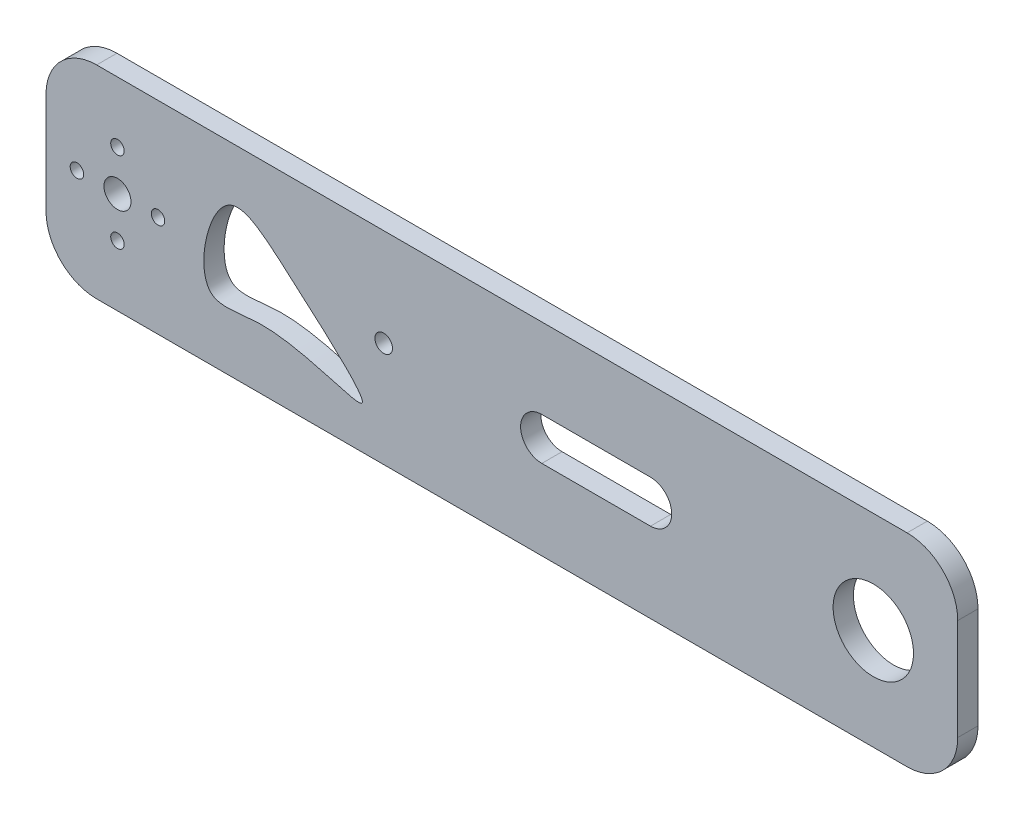
ISO-10303-21;
HEADER;
FILE_DESCRIPTION(('STEP AP214'),'2;1');
FILE_NAME('part.step','',(''),(''),'','','');
FILE_SCHEMA(('AUTOMOTIVE_DESIGN { 1 0 10303 214 1 1 1 1 }'));
ENDSEC;
DATA;
#1=APPLICATION_CONTEXT('core data for automotive mechanical design processes');
#2=APPLICATION_PROTOCOL_DEFINITION('international standard','automotive_design',2000,#1);
#3=PRODUCT_CONTEXT('',#1,'mechanical');
#4=PRODUCT('Part','Part','',(#3));
#5=PRODUCT_RELATED_PRODUCT_CATEGORY('part','',(#4));
#6=PRODUCT_DEFINITION_FORMATION('','',#4);
#7=PRODUCT_DEFINITION_CONTEXT('part definition',#1,'design');
#8=PRODUCT_DEFINITION('design','',#6,#7);
#9=PRODUCT_DEFINITION_SHAPE('','',#8);
#10=(LENGTH_UNIT() NAMED_UNIT(*) SI_UNIT(.MILLI.,.METRE.));
#11=(NAMED_UNIT(*) PLANE_ANGLE_UNIT() SI_UNIT($,.RADIAN.));
#12=(NAMED_UNIT(*) SI_UNIT($,.STERADIAN.) SOLID_ANGLE_UNIT());
#13=UNCERTAINTY_MEASURE_WITH_UNIT(LENGTH_MEASURE(1.E-05),#10,'distance_accuracy_value','');
#14=(GEOMETRIC_REPRESENTATION_CONTEXT(3) GLOBAL_UNCERTAINTY_ASSIGNED_CONTEXT((#13)) GLOBAL_UNIT_ASSIGNED_CONTEXT((#10,
#11,#12)) REPRESENTATION_CONTEXT('',''));
#15=CARTESIAN_POINT('',(0.,0.,0.));
#16=DIRECTION('',(0.,0.,1.));
#17=DIRECTION('',(1.,0.,0.));
#18=AXIS2_PLACEMENT_3D('',#15,#16,#17);
#19=CARTESIAN_POINT('',(135.,30.,3.));
#20=DIRECTION('',(-1.,0.,0.));
#21=DIRECTION('',(0.,0.,1.));
#22=AXIS2_PLACEMENT_3D('',#19,#20,#21);
#23=PLANE('',#22);
#24=DIRECTION('',(0.,1.,0.));
#25=VECTOR('',#24,1.);
#26=CARTESIAN_POINT('',(135.,30.,3.));
#27=LINE('',#26,#25);
#28=CARTESIAN_POINT('',(135.,-15.,3.));
#29=VERTEX_POINT('',#28);
#30=CARTESIAN_POINT('',(135.,15.,3.));
#31=VERTEX_POINT('',#30);
#32=EDGE_CURVE('E496',#29,#31,#27,.T.);
#33=ORIENTED_EDGE('',*,*,#32,.F.);
#34=DIRECTION('',(0.,0.,-1.));
#35=VECTOR('',#34,1.);
#36=CARTESIAN_POINT('',(135.,-15.,3.));
#37=LINE('',#36,#35);
#38=CARTESIAN_POINT('',(135.,-15.,-3.));
#39=VERTEX_POINT('',#38);
#40=EDGE_CURVE('E477',#29,#39,#37,.T.);
#41=ORIENTED_EDGE('',*,*,#40,.T.);
#42=DIRECTION('',(0.,1.,0.));
#43=VECTOR('',#42,1.);
#44=CARTESIAN_POINT('',(135.,30.,-3.));
#45=LINE('',#44,#43);
#46=CARTESIAN_POINT('',(135.,15.,-3.));
#47=VERTEX_POINT('',#46);
#48=EDGE_CURVE('E281',#39,#47,#45,.T.);
#49=ORIENTED_EDGE('',*,*,#48,.T.);
#50=DIRECTION('',(0.,0.,-1.));
#51=VECTOR('',#50,1.);
#52=CARTESIAN_POINT('',(135.,15.,3.));
#53=LINE('',#52,#51);
#54=EDGE_CURVE('E471',#47,#31,#53,.F.);
#55=ORIENTED_EDGE('',*,*,#54,.T.);
#56=EDGE_LOOP('',(#33,#41,#49,#55));
#57=FACE_BOUND('',#56,.T.);
#58=ADVANCED_FACE('F34',(#57),#23,.F.);
#59=CARTESIAN_POINT('',(-135.,30.,3.));
#60=DIRECTION('',(0.,-1.,0.));
#61=DIRECTION('',(0.,0.,-1.));
#62=AXIS2_PLACEMENT_3D('',#59,#60,#61);
#63=PLANE('',#62);
#64=DIRECTION('',(-1.,0.,0.));
#65=VECTOR('',#64,1.);
#66=CARTESIAN_POINT('',(-135.,30.,3.));
#67=LINE('',#66,#65);
#68=CARTESIAN_POINT('',(120.,30.,3.));
#69=VERTEX_POINT('',#68);
#70=CARTESIAN_POINT('',(-120.,30.,3.));
#71=VERTEX_POINT('',#70);
#72=EDGE_CURVE('E498',#69,#71,#67,.T.);
#73=ORIENTED_EDGE('',*,*,#72,.F.);
#74=DIRECTION('',(0.,0.,-1.));
#75=VECTOR('',#74,1.);
#76=CARTESIAN_POINT('',(120.,30.,3.));
#77=LINE('',#76,#75);
#78=CARTESIAN_POINT('',(120.,30.,-3.));
#79=VERTEX_POINT('',#78);
#80=EDGE_CURVE('E257',#69,#79,#77,.T.);
#81=ORIENTED_EDGE('',*,*,#80,.T.);
#82=DIRECTION('',(-1.,0.,0.));
#83=VECTOR('',#82,1.);
#84=CARTESIAN_POINT('',(-135.,30.,-3.));
#85=LINE('',#84,#83);
#86=CARTESIAN_POINT('',(-120.,30.,-3.));
#87=VERTEX_POINT('',#86);
#88=EDGE_CURVE('E501',#79,#87,#85,.T.);
#89=ORIENTED_EDGE('',*,*,#88,.T.);
#90=DIRECTION('',(0.,0.,-1.));
#91=VECTOR('',#90,1.);
#92=CARTESIAN_POINT('',(-120.,30.,3.));
#93=LINE('',#92,#91);
#94=EDGE_CURVE('E255',#87,#71,#93,.F.);
#95=ORIENTED_EDGE('',*,*,#94,.T.);
#96=EDGE_LOOP('',(#73,#81,#89,#95));
#97=FACE_BOUND('',#96,.T.);
#98=ADVANCED_FACE('F213',(#97),#63,.F.);
#99=CARTESIAN_POINT('',(-135.,30.,3.));
#100=DIRECTION('',(1.,0.,0.));
#101=DIRECTION('',(0.,0.,-1.));
#102=AXIS2_PLACEMENT_3D('',#99,#100,#101);
#103=PLANE('',#102);
#104=DIRECTION('',(0.,-1.,0.));
#105=VECTOR('',#104,1.);
#106=CARTESIAN_POINT('',(-135.,30.,-3.));
#107=LINE('',#106,#105);
#108=CARTESIAN_POINT('',(-135.,15.,-3.));
#109=VERTEX_POINT('',#108);
#110=CARTESIAN_POINT('',(-135.,-15.,-3.));
#111=VERTEX_POINT('',#110);
#112=EDGE_CURVE('E497',#109,#111,#107,.T.);
#113=ORIENTED_EDGE('',*,*,#112,.T.);
#114=DIRECTION('',(0.,0.,-1.));
#115=VECTOR('',#114,1.);
#116=CARTESIAN_POINT('',(-135.,-15.,3.));
#117=LINE('',#116,#115);
#118=CARTESIAN_POINT('',(-135.,-15.,3.));
#119=VERTEX_POINT('',#118);
#120=EDGE_CURVE('E238',#111,#119,#117,.F.);
#121=ORIENTED_EDGE('',*,*,#120,.T.);
#122=DIRECTION('',(0.,-1.,0.));
#123=VECTOR('',#122,1.);
#124=CARTESIAN_POINT('',(-135.,30.,3.));
#125=LINE('',#124,#123);
#126=CARTESIAN_POINT('',(-135.,15.,3.));
#127=VERTEX_POINT('',#126);
#128=EDGE_CURVE('E472',#127,#119,#125,.T.);
#129=ORIENTED_EDGE('',*,*,#128,.F.);
#130=DIRECTION('',(0.,0.,-1.));
#131=VECTOR('',#130,1.);
#132=CARTESIAN_POINT('',(-135.,15.,3.));
#133=LINE('',#132,#131);
#134=EDGE_CURVE('E260',#127,#109,#133,.T.);
#135=ORIENTED_EDGE('',*,*,#134,.T.);
#136=EDGE_LOOP('',(#113,#121,#129,#135));
#137=FACE_BOUND('',#136,.T.);
#138=ADVANCED_FACE('F209',(#137),#103,.F.);
#139=CARTESIAN_POINT('',(-135.,-30.,3.));
#140=DIRECTION('',(0.,1.,0.));
#141=DIRECTION('',(0.,0.,1.));
#142=AXIS2_PLACEMENT_3D('',#139,#140,#141);
#143=PLANE('',#142);
#144=DIRECTION('',(1.,0.,0.));
#145=VECTOR('',#144,1.);
#146=CARTESIAN_POINT('',(-135.,-30.,-3.));
#147=LINE('',#146,#145);
#148=CARTESIAN_POINT('',(-120.,-30.,-3.));
#149=VERTEX_POINT('',#148);
#150=CARTESIAN_POINT('',(120.,-30.,-3.));
#151=VERTEX_POINT('',#150);
#152=EDGE_CURVE('E494',#149,#151,#147,.T.);
#153=ORIENTED_EDGE('',*,*,#152,.T.);
#154=DIRECTION('',(0.,0.,-1.));
#155=VECTOR('',#154,1.);
#156=CARTESIAN_POINT('',(120.,-30.,3.));
#157=LINE('',#156,#155);
#158=CARTESIAN_POINT('',(120.,-30.,3.));
#159=VERTEX_POINT('',#158);
#160=EDGE_CURVE('E250',#151,#159,#157,.F.);
#161=ORIENTED_EDGE('',*,*,#160,.T.);
#162=DIRECTION('',(1.,0.,0.));
#163=VECTOR('',#162,1.);
#164=CARTESIAN_POINT('',(-135.,-30.,3.));
#165=LINE('',#164,#163);
#166=CARTESIAN_POINT('',(-120.,-30.,3.));
#167=VERTEX_POINT('',#166);
#168=EDGE_CURVE('E467',#167,#159,#165,.T.);
#169=ORIENTED_EDGE('',*,*,#168,.F.);
#170=DIRECTION('',(0.,0.,-1.));
#171=VECTOR('',#170,1.);
#172=CARTESIAN_POINT('',(-120.,-30.,3.));
#173=LINE('',#172,#171);
#174=EDGE_CURVE('E240',#167,#149,#173,.T.);
#175=ORIENTED_EDGE('',*,*,#174,.T.);
#176=EDGE_LOOP('',(#153,#161,#169,#175));
#177=FACE_BOUND('',#176,.T.);
#178=ADVANCED_FACE('F202',(#177),#143,.F.);
#179=CARTESIAN_POINT('',(0.,0.,3.));
#180=DIRECTION('',(0.,0.,1.));
#181=DIRECTION('',(1.,0.,0.));
#182=AXIS2_PLACEMENT_3D('',#179,#180,#181);
#183=PLANE('',#182);
#184=CARTESIAN_POINT('',(11.8296106303526,0.,3.));
#185=DIRECTION('',(0.,0.,1.));
#186=DIRECTION('',(1.,0.,0.));
#187=AXIS2_PLACEMENT_3D('',#184,#185,#186);
#188=CIRCLE('',#187,6.28053164739129);
#189=CARTESIAN_POINT('',(11.8296106303526,6.28053164739129,3.));
#190=VERTEX_POINT('',#189);
#191=CARTESIAN_POINT('',(11.8296106303526,-6.28053164739129,3.));
#192=VERTEX_POINT('',#191);
#193=EDGE_CURVE('E49',#190,#192,#188,.T.);
#194=ORIENTED_EDGE('',*,*,#193,.F.);
#195=DIRECTION('',(-1.,0.,0.));
#196=VECTOR('',#195,1.);
#197=CARTESIAN_POINT('',(11.8296106303526,6.28053164739129,3.));
#198=LINE('',#197,#196);
#199=CARTESIAN_POINT('',(44.0100175998004,6.28053164739129,3.));
#200=VERTEX_POINT('',#199);
#201=EDGE_CURVE('E142',#200,#190,#198,.T.);
#202=ORIENTED_EDGE('',*,*,#201,.F.);
#203=CARTESIAN_POINT('',(44.0100175998004,0.,3.));
#204=DIRECTION('',(0.,0.,1.));
#205=DIRECTION('',(1.,0.,0.));
#206=AXIS2_PLACEMENT_3D('',#203,#204,#205);
#207=CIRCLE('',#206,6.28053164739129);
#208=CARTESIAN_POINT('',(44.0100175998004,-6.28053164739129,3.));
#209=VERTEX_POINT('',#208);
#210=EDGE_CURVE('E126',#209,#200,#207,.T.);
#211=ORIENTED_EDGE('',*,*,#210,.F.);
#212=DIRECTION('',(1.,0.,0.));
#213=VECTOR('',#212,1.);
#214=CARTESIAN_POINT('',(11.8296106303526,-6.28053164739129,3.));
#215=LINE('',#214,#213);
#216=EDGE_CURVE('E135',#192,#209,#215,.T.);
#217=ORIENTED_EDGE('',*,*,#216,.F.);
#218=EDGE_LOOP('',(#194,#202,#211,#217));
#219=FACE_BOUND('',#218,.T.);
#220=CARTESIAN_POINT('',(-86.0182331804512,-11.6052804049951,3.));
#221=CARTESIAN_POINT('',(-83.2354508799588,-14.0450263619246,3.));
#222=CARTESIAN_POINT('',(-65.9297527283585,-8.61770067668569,3.));
#223=CARTESIAN_POINT('',(-27.0991493719671,-26.6229889453018,3.));
#224=CARTESIAN_POINT('',(-60.5624525641297,2.39071624951274,3.));
#225=CARTESIAN_POINT('',(-84.2293753403954,23.0926849093463,3.));
#226=CARTESIAN_POINT('',(-90.9561758645381,-7.27604282973843,3.));
#227=CARTESIAN_POINT('',(-86.0182331804512,-11.6052804049951,3.));
#228=B_SPLINE_CURVE_WITH_KNOTS('',3,(#220,#221,#222,#223,#224,#225,#226,#227),.UNSPECIFIED.,.T.,
.F.,(4,1,1,1,1,4),(0.,0.119398718854948,0.370043286577663,0.632863572495671,0.788131457442852,
1.),.UNSPECIFIED.);
#229=CARTESIAN_POINT('',(-86.0182331804512,-11.6052804049951,3.));
#230=VERTEX_POINT('',#229);
#231=EDGE_CURVE('E156',#230,#230,#228,.T.);
#232=ORIENTED_EDGE('',*,*,#231,.F.);
#233=EDGE_LOOP('',(#232));
#234=FACE_BOUND('',#233,.T.);
#235=CARTESIAN_POINT('',(-35.,1.12326696580291,3.));
#236=DIRECTION('',(0.,0.,1.));
#237=DIRECTION('',(1.,0.,0.));
#238=AXIS2_PLACEMENT_3D('',#235,#236,#237);
#239=CIRCLE('',#238,2.6);
#240=CARTESIAN_POINT('',(-32.4,1.12326696580291,3.));
#241=VERTEX_POINT('',#240);
#242=EDGE_CURVE('E286',#241,#241,#239,.T.);
#243=ORIENTED_EDGE('',*,*,#242,.F.);
#244=EDGE_LOOP('',(#243));
#245=FACE_BOUND('',#244,.T.);
#246=CARTESIAN_POINT('',(110.,0.,3.));
#247=DIRECTION('',(0.,0.,1.));
#248=DIRECTION('',(1.,0.,0.));
#249=AXIS2_PLACEMENT_3D('',#246,#247,#248);
#250=CIRCLE('',#249,11.9);
#251=CARTESIAN_POINT('',(121.9,0.,3.));
#252=VERTEX_POINT('',#251);
#253=EDGE_CURVE('E294',#252,#252,#250,.T.);
#254=ORIENTED_EDGE('',*,*,#253,.F.);
#255=EDGE_LOOP('',(#254));
#256=FACE_BOUND('',#255,.T.);
#257=CARTESIAN_POINT('',(-113.835271992654,12.,3.));
#258=DIRECTION('',(0.,0.,1.));
#259=DIRECTION('',(1.,0.,0.));
#260=AXIS2_PLACEMENT_3D('',#257,#258,#259);
#261=CIRCLE('',#260,2.);
#262=CARTESIAN_POINT('',(-111.835271992654,12.,3.));
#263=VERTEX_POINT('',#262);
#264=EDGE_CURVE('E453',#263,#263,#261,.T.);
#265=ORIENTED_EDGE('',*,*,#264,.F.);
#266=EDGE_LOOP('',(#265));
#267=FACE_BOUND('',#266,.T.);
#268=CARTESIAN_POINT('',(-113.835271992654,-12.,3.));
#269=DIRECTION('',(0.,0.,1.));
#270=DIRECTION('',(-1.,0.,0.));
#271=AXIS2_PLACEMENT_3D('',#268,#269,#270);
#272=CIRCLE('',#271,2.);
#273=CARTESIAN_POINT('',(-115.835271992654,-12.,3.));
#274=VERTEX_POINT('',#273);
#275=EDGE_CURVE('E457',#274,#274,#272,.T.);
#276=ORIENTED_EDGE('',*,*,#275,.F.);
#277=EDGE_LOOP('',(#276));
#278=FACE_BOUND('',#277,.T.);
#279=CARTESIAN_POINT('',(-101.835271992654,0.,3.));
#280=DIRECTION('',(0.,0.,1.));
#281=DIRECTION('',(1.,0.,0.));
#282=AXIS2_PLACEMENT_3D('',#279,#280,#281);
#283=CIRCLE('',#282,2.);
#284=CARTESIAN_POINT('',(-99.8352719926538,0.,3.));
#285=VERTEX_POINT('',#284);
#286=EDGE_CURVE('E461',#285,#285,#283,.T.);
#287=ORIENTED_EDGE('',*,*,#286,.F.);
#288=EDGE_LOOP('',(#287));
#289=FACE_BOUND('',#288,.T.);
#290=CARTESIAN_POINT('',(-125.835271992654,0.,3.));
#291=DIRECTION('',(0.,0.,1.));
#292=DIRECTION('',(-1.,0.,0.));
#293=AXIS2_PLACEMENT_3D('',#290,#291,#292);
#294=CIRCLE('',#293,2.);
#295=CARTESIAN_POINT('',(-127.835271992654,0.,3.));
#296=VERTEX_POINT('',#295);
#297=EDGE_CURVE('E289',#296,#296,#294,.T.);
#298=ORIENTED_EDGE('',*,*,#297,.F.);
#299=EDGE_LOOP('',(#298));
#300=FACE_BOUND('',#299,.T.);
#301=CARTESIAN_POINT('',(-113.835271992654,0.,3.));
#302=DIRECTION('',(0.,0.,1.));
#303=DIRECTION('',(1.,0.,0.));
#304=AXIS2_PLACEMENT_3D('',#301,#302,#303);
#305=CIRCLE('',#304,4.00000000000001);
#306=CARTESIAN_POINT('',(-109.835271992654,0.,3.));
#307=VERTEX_POINT('',#306);
#308=EDGE_CURVE('E269',#307,#307,#305,.T.);
#309=ORIENTED_EDGE('',*,*,#308,.F.);
#310=EDGE_LOOP('',(#309));
#311=FACE_BOUND('',#310,.T.);
#312=ORIENTED_EDGE('',*,*,#168,.T.);
#313=CARTESIAN_POINT('',(120.,-15.,3.));
#314=DIRECTION('',(0.,0.,1.));
#315=DIRECTION('',(1.,0.,0.));
#316=AXIS2_PLACEMENT_3D('',#313,#314,#315);
#317=CIRCLE('',#316,15.);
#318=EDGE_CURVE('E248',#159,#29,#317,.T.);
#319=ORIENTED_EDGE('',*,*,#318,.T.);
#320=ORIENTED_EDGE('',*,*,#32,.T.);
#321=CARTESIAN_POINT('',(120.,15.,3.));
#322=DIRECTION('',(0.,0.,1.));
#323=DIRECTION('',(1.,0.,0.));
#324=AXIS2_PLACEMENT_3D('',#321,#322,#323);
#325=CIRCLE('',#324,15.);
#326=EDGE_CURVE('E245',#31,#69,#325,.T.);
#327=ORIENTED_EDGE('',*,*,#326,.T.);
#328=ORIENTED_EDGE('',*,*,#72,.T.);
#329=CARTESIAN_POINT('',(-120.,15.,3.));
#330=DIRECTION('',(0.,0.,1.));
#331=DIRECTION('',(1.,0.,0.));
#332=AXIS2_PLACEMENT_3D('',#329,#330,#331);
#333=CIRCLE('',#332,15.);
#334=EDGE_CURVE('E246',#71,#127,#333,.T.);
#335=ORIENTED_EDGE('',*,*,#334,.T.);
#336=ORIENTED_EDGE('',*,*,#128,.T.);
#337=CARTESIAN_POINT('',(-120.,-15.,3.));
#338=DIRECTION('',(0.,0.,1.));
#339=DIRECTION('',(1.,0.,0.));
#340=AXIS2_PLACEMENT_3D('',#337,#338,#339);
#341=CIRCLE('',#340,15.);
#342=EDGE_CURVE('E237',#119,#167,#341,.T.);
#343=ORIENTED_EDGE('',*,*,#342,.T.);
#344=EDGE_LOOP('',(#312,#319,#320,#327,#328,#335,#336,#343));
#345=FACE_BOUND('',#344,.T.);
#346=ADVANCED_FACE('F139',(#219,#234,#245,#256,#267,#278,#289,#300,#311,#345),#183,.T.);
#347=CARTESIAN_POINT('',(0.,0.,-3.));
#348=DIRECTION('',(0.,0.,1.));
#349=DIRECTION('',(1.,0.,0.));
#350=AXIS2_PLACEMENT_3D('',#347,#348,#349);
#351=PLANE('',#350);
#352=DIRECTION('',(-1.,0.,0.));
#353=VECTOR('',#352,1.);
#354=CARTESIAN_POINT('',(0.,6.28053164739129,-3.));
#355=LINE('',#354,#353);
#356=CARTESIAN_POINT('',(44.0100175998004,6.28053164739129,-3.));
#357=VERTEX_POINT('',#356);
#358=CARTESIAN_POINT('',(11.8296106303526,6.28053164739129,-3.));
#359=VERTEX_POINT('',#358);
#360=EDGE_CURVE('E42',#357,#359,#355,.T.);
#361=ORIENTED_EDGE('',*,*,#360,.T.);
#362=CARTESIAN_POINT('',(11.8296106303526,0.,-3.));
#363=DIRECTION('',(0.,0.,1.));
#364=DIRECTION('',(1.,0.,0.));
#365=AXIS2_PLACEMENT_3D('',#362,#363,#364);
#366=CIRCLE('',#365,6.28053164739129);
#367=CARTESIAN_POINT('',(11.8296106303526,-6.28053164739129,-3.));
#368=VERTEX_POINT('',#367);
#369=EDGE_CURVE('E11',#359,#368,#366,.T.);
#370=ORIENTED_EDGE('',*,*,#369,.T.);
#371=DIRECTION('',(1.,0.,0.));
#372=VECTOR('',#371,1.);
#373=CARTESIAN_POINT('',(0.,-6.28053164739129,-3.));
#374=LINE('',#373,#372);
#375=CARTESIAN_POINT('',(44.0100175998004,-6.28053164739129,-3.));
#376=VERTEX_POINT('',#375);
#377=EDGE_CURVE('E264',#368,#376,#374,.T.);
#378=ORIENTED_EDGE('',*,*,#377,.T.);
#379=CARTESIAN_POINT('',(44.0100175998004,0.,-3.));
#380=DIRECTION('',(0.,0.,1.));
#381=DIRECTION('',(1.,0.,0.));
#382=AXIS2_PLACEMENT_3D('',#379,#380,#381);
#383=CIRCLE('',#382,6.28053164739129);
#384=EDGE_CURVE('E129',#376,#357,#383,.T.);
#385=ORIENTED_EDGE('',*,*,#384,.T.);
#386=EDGE_LOOP('',(#361,#370,#378,#385));
#387=FACE_BOUND('',#386,.T.);
#388=CARTESIAN_POINT('',(-86.0182331804512,-11.6052804049951,-3.));
#389=CARTESIAN_POINT('',(-83.2354508799588,-14.0450263619246,-3.));
#390=CARTESIAN_POINT('',(-65.9297527283585,-8.61770067668569,-3.));
#391=CARTESIAN_POINT('',(-27.0991493719671,-26.6229889453018,-3.));
#392=CARTESIAN_POINT('',(-60.5624525641297,2.39071624951274,-3.));
#393=CARTESIAN_POINT('',(-84.2293753403954,23.0926849093463,-3.));
#394=CARTESIAN_POINT('',(-90.9561758645381,-7.27604282973843,-3.));
#395=CARTESIAN_POINT('',(-86.0182331804512,-11.6052804049951,-3.));
#396=B_SPLINE_CURVE_WITH_KNOTS('',3,(#388,#389,#390,#391,#392,#393,#394,#395),.UNSPECIFIED.,.T.,
.F.,(4,1,1,1,1,4),(0.,0.119398718854948,0.370043286577663,0.632863572495671,0.788131457442852,
1.),.UNSPECIFIED.);
#397=CARTESIAN_POINT('',(-86.0182331804512,-11.6052804049951,-3.));
#398=VERTEX_POINT('',#397);
#399=EDGE_CURVE('E149',#398,#398,#396,.T.);
#400=ORIENTED_EDGE('',*,*,#399,.T.);
#401=EDGE_LOOP('',(#400));
#402=FACE_BOUND('',#401,.T.);
#403=CARTESIAN_POINT('',(-35.,1.12326696580291,-3.));
#404=DIRECTION('',(0.,0.,1.));
#405=DIRECTION('',(1.,0.,0.));
#406=AXIS2_PLACEMENT_3D('',#403,#404,#405);
#407=CIRCLE('',#406,2.6);
#408=CARTESIAN_POINT('',(-32.4,1.12326696580291,-3.));
#409=VERTEX_POINT('',#408);
#410=EDGE_CURVE('E285',#409,#409,#407,.T.);
#411=ORIENTED_EDGE('',*,*,#410,.T.);
#412=EDGE_LOOP('',(#411));
#413=FACE_BOUND('',#412,.T.);
#414=CARTESIAN_POINT('',(110.,0.,-3.));
#415=DIRECTION('',(0.,0.,1.));
#416=DIRECTION('',(1.,0.,0.));
#417=AXIS2_PLACEMENT_3D('',#414,#415,#416);
#418=CIRCLE('',#417,11.9);
#419=CARTESIAN_POINT('',(121.9,0.,-3.));
#420=VERTEX_POINT('',#419);
#421=EDGE_CURVE('E282',#420,#420,#418,.T.);
#422=ORIENTED_EDGE('',*,*,#421,.T.);
#423=EDGE_LOOP('',(#422));
#424=FACE_BOUND('',#423,.T.);
#425=CARTESIAN_POINT('',(-113.835271992654,12.,-3.));
#426=DIRECTION('',(0.,0.,1.));
#427=DIRECTION('',(1.,0.,0.));
#428=AXIS2_PLACEMENT_3D('',#425,#426,#427);
#429=CIRCLE('',#428,2.);
#430=CARTESIAN_POINT('',(-111.835271992654,12.,-3.));
#431=VERTEX_POINT('',#430);
#432=EDGE_CURVE('E278',#431,#431,#429,.T.);
#433=ORIENTED_EDGE('',*,*,#432,.T.);
#434=EDGE_LOOP('',(#433));
#435=FACE_BOUND('',#434,.T.);
#436=CARTESIAN_POINT('',(-113.835271992654,-12.,-3.));
#437=DIRECTION('',(0.,0.,1.));
#438=DIRECTION('',(1.,0.,0.));
#439=AXIS2_PLACEMENT_3D('',#436,#437,#438);
#440=CIRCLE('',#439,2.);
#441=CARTESIAN_POINT('',(-111.835271992654,-12.,-3.));
#442=VERTEX_POINT('',#441);
#443=EDGE_CURVE('E275',#442,#442,#440,.T.);
#444=ORIENTED_EDGE('',*,*,#443,.T.);
#445=EDGE_LOOP('',(#444));
#446=FACE_BOUND('',#445,.T.);
#447=CARTESIAN_POINT('',(-101.835271992654,0.,-3.));
#448=DIRECTION('',(0.,0.,1.));
#449=DIRECTION('',(1.,0.,0.));
#450=AXIS2_PLACEMENT_3D('',#447,#448,#449);
#451=CIRCLE('',#450,2.);
#452=CARTESIAN_POINT('',(-99.8352719926538,0.,-3.));
#453=VERTEX_POINT('',#452);
#454=EDGE_CURVE('E272',#453,#453,#451,.T.);
#455=ORIENTED_EDGE('',*,*,#454,.T.);
#456=EDGE_LOOP('',(#455));
#457=FACE_BOUND('',#456,.T.);
#458=CARTESIAN_POINT('',(-125.835271992654,0.,-3.));
#459=DIRECTION('',(0.,0.,1.));
#460=DIRECTION('',(1.,0.,0.));
#461=AXIS2_PLACEMENT_3D('',#458,#459,#460);
#462=CIRCLE('',#461,2.);
#463=CARTESIAN_POINT('',(-123.835271992654,0.,-3.));
#464=VERTEX_POINT('',#463);
#465=EDGE_CURVE('E268',#464,#464,#462,.T.);
#466=ORIENTED_EDGE('',*,*,#465,.T.);
#467=EDGE_LOOP('',(#466));
#468=FACE_BOUND('',#467,.T.);
#469=CARTESIAN_POINT('',(-113.835271992654,0.,-3.));
#470=DIRECTION('',(0.,0.,1.));
#471=DIRECTION('',(1.,0.,0.));
#472=AXIS2_PLACEMENT_3D('',#469,#470,#471);
#473=CIRCLE('',#472,4.00000000000001);
#474=CARTESIAN_POINT('',(-109.835271992654,0.,-3.));
#475=VERTEX_POINT('',#474);
#476=EDGE_CURVE('E265',#475,#475,#473,.T.);
#477=ORIENTED_EDGE('',*,*,#476,.T.);
#478=EDGE_LOOP('',(#477));
#479=FACE_BOUND('',#478,.T.);
#480=ORIENTED_EDGE('',*,*,#48,.F.);
#481=CARTESIAN_POINT('',(120.,-15.,-3.));
#482=DIRECTION('',(0.,0.,1.));
#483=DIRECTION('',(1.,0.,0.));
#484=AXIS2_PLACEMENT_3D('',#481,#482,#483);
#485=CIRCLE('',#484,15.);
#486=EDGE_CURVE('E478',#39,#151,#485,.F.);
#487=ORIENTED_EDGE('',*,*,#486,.T.);
#488=ORIENTED_EDGE('',*,*,#152,.F.);
#489=CARTESIAN_POINT('',(-120.,-15.,-3.));
#490=DIRECTION('',(0.,0.,1.));
#491=DIRECTION('',(1.,0.,0.));
#492=AXIS2_PLACEMENT_3D('',#489,#490,#491);
#493=CIRCLE('',#492,15.);
#494=EDGE_CURVE('E483',#149,#111,#493,.F.);
#495=ORIENTED_EDGE('',*,*,#494,.T.);
#496=ORIENTED_EDGE('',*,*,#112,.F.);
#497=CARTESIAN_POINT('',(-120.,15.,-3.));
#498=DIRECTION('',(0.,0.,1.));
#499=DIRECTION('',(1.,0.,0.));
#500=AXIS2_PLACEMENT_3D('',#497,#498,#499);
#501=CIRCLE('',#500,15.);
#502=EDGE_CURVE('E481',#109,#87,#501,.F.);
#503=ORIENTED_EDGE('',*,*,#502,.T.);
#504=ORIENTED_EDGE('',*,*,#88,.F.);
#505=CARTESIAN_POINT('',(120.,15.,-3.));
#506=DIRECTION('',(0.,0.,1.));
#507=DIRECTION('',(1.,0.,0.));
#508=AXIS2_PLACEMENT_3D('',#505,#506,#507);
#509=CIRCLE('',#508,15.);
#510=EDGE_CURVE('E489',#79,#47,#509,.F.);
#511=ORIENTED_EDGE('',*,*,#510,.T.);
#512=EDGE_LOOP('',(#480,#487,#488,#495,#496,#503,#504,#511));
#513=FACE_BOUND('',#512,.T.);
#514=ADVANCED_FACE('F201',(#387,#402,#413,#424,#435,#446,#457,#468,#479,#513),#351,.F.);
#515=CARTESIAN_POINT('',(120.,-15.,3.));
#516=DIRECTION('',(0.,0.,-1.));
#517=DIRECTION('',(-1.,0.,0.));
#518=AXIS2_PLACEMENT_3D('',#515,#516,#517);
#519=CYLINDRICAL_SURFACE('',#518,15.);
#520=ORIENTED_EDGE('',*,*,#318,.F.);
#521=ORIENTED_EDGE('',*,*,#160,.F.);
#522=ORIENTED_EDGE('',*,*,#486,.F.);
#523=ORIENTED_EDGE('',*,*,#40,.F.);
#524=EDGE_LOOP('',(#520,#521,#522,#523));
#525=FACE_BOUND('',#524,.T.);
#526=ADVANCED_FACE('F205',(#525),#519,.T.);
#527=CARTESIAN_POINT('',(120.,15.,3.));
#528=DIRECTION('',(0.,0.,-1.));
#529=DIRECTION('',(-1.,0.,0.));
#530=AXIS2_PLACEMENT_3D('',#527,#528,#529);
#531=CYLINDRICAL_SURFACE('',#530,15.);
#532=ORIENTED_EDGE('',*,*,#326,.F.);
#533=ORIENTED_EDGE('',*,*,#54,.F.);
#534=ORIENTED_EDGE('',*,*,#510,.F.);
#535=ORIENTED_EDGE('',*,*,#80,.F.);
#536=EDGE_LOOP('',(#532,#533,#534,#535));
#537=FACE_BOUND('',#536,.T.);
#538=ADVANCED_FACE('F223',(#537),#531,.T.);
#539=CARTESIAN_POINT('',(-120.,-15.,3.));
#540=DIRECTION('',(0.,0.,-1.));
#541=DIRECTION('',(-1.,0.,0.));
#542=AXIS2_PLACEMENT_3D('',#539,#540,#541);
#543=CYLINDRICAL_SURFACE('',#542,15.);
#544=ORIENTED_EDGE('',*,*,#342,.F.);
#545=ORIENTED_EDGE('',*,*,#120,.F.);
#546=ORIENTED_EDGE('',*,*,#494,.F.);
#547=ORIENTED_EDGE('',*,*,#174,.F.);
#548=EDGE_LOOP('',(#544,#545,#546,#547));
#549=FACE_BOUND('',#548,.T.);
#550=ADVANCED_FACE('F226',(#549),#543,.T.);
#551=CARTESIAN_POINT('',(-120.,15.,3.));
#552=DIRECTION('',(0.,0.,-1.));
#553=DIRECTION('',(-1.,0.,0.));
#554=AXIS2_PLACEMENT_3D('',#551,#552,#553);
#555=CYLINDRICAL_SURFACE('',#554,15.);
#556=ORIENTED_EDGE('',*,*,#334,.F.);
#557=ORIENTED_EDGE('',*,*,#94,.F.);
#558=ORIENTED_EDGE('',*,*,#502,.F.);
#559=ORIENTED_EDGE('',*,*,#134,.F.);
#560=EDGE_LOOP('',(#556,#557,#558,#559));
#561=FACE_BOUND('',#560,.T.);
#562=ADVANCED_FACE('F36',(#561),#555,.T.);
#563=CARTESIAN_POINT('',(-113.835271992654,0.,-5.));
#564=DIRECTION('',(0.,0.,1.));
#565=DIRECTION('',(1.,0.,0.));
#566=AXIS2_PLACEMENT_3D('',#563,#564,#565);
#567=CYLINDRICAL_SURFACE('',#566,4.00000000000001);
#568=ORIENTED_EDGE('',*,*,#308,.T.);
#569=EDGE_LOOP('',(#568));
#570=FACE_BOUND('',#569,.T.);
#571=ORIENTED_EDGE('',*,*,#476,.F.);
#572=EDGE_LOOP('',(#571));
#573=FACE_BOUND('',#572,.T.);
#574=ADVANCED_FACE('F188',(#570,#573),#567,.F.);
#575=CARTESIAN_POINT('',(-125.835271992654,0.,-5.));
#576=DIRECTION('',(0.,0.,1.));
#577=DIRECTION('',(1.,0.,0.));
#578=AXIS2_PLACEMENT_3D('',#575,#576,#577);
#579=CYLINDRICAL_SURFACE('',#578,2.);
#580=ORIENTED_EDGE('',*,*,#297,.T.);
#581=EDGE_LOOP('',(#580));
#582=FACE_BOUND('',#581,.T.);
#583=ORIENTED_EDGE('',*,*,#465,.F.);
#584=EDGE_LOOP('',(#583));
#585=FACE_BOUND('',#584,.T.);
#586=ADVANCED_FACE('F184',(#582,#585),#579,.F.);
#587=CARTESIAN_POINT('',(-101.835271992654,0.,-5.));
#588=DIRECTION('',(0.,0.,1.));
#589=DIRECTION('',(1.,0.,0.));
#590=AXIS2_PLACEMENT_3D('',#587,#588,#589);
#591=CYLINDRICAL_SURFACE('',#590,2.);
#592=ORIENTED_EDGE('',*,*,#286,.T.);
#593=EDGE_LOOP('',(#592));
#594=FACE_BOUND('',#593,.T.);
#595=ORIENTED_EDGE('',*,*,#454,.F.);
#596=EDGE_LOOP('',(#595));
#597=FACE_BOUND('',#596,.T.);
#598=ADVANCED_FACE('F180',(#594,#597),#591,.F.);
#599=CARTESIAN_POINT('',(-113.835271992654,-12.,-5.));
#600=DIRECTION('',(0.,0.,1.));
#601=DIRECTION('',(1.,0.,0.));
#602=AXIS2_PLACEMENT_3D('',#599,#600,#601);
#603=CYLINDRICAL_SURFACE('',#602,2.);
#604=ORIENTED_EDGE('',*,*,#275,.T.);
#605=EDGE_LOOP('',(#604));
#606=FACE_BOUND('',#605,.T.);
#607=ORIENTED_EDGE('',*,*,#443,.F.);
#608=EDGE_LOOP('',(#607));
#609=FACE_BOUND('',#608,.T.);
#610=ADVANCED_FACE('F183',(#606,#609),#603,.F.);
#611=CARTESIAN_POINT('',(-113.835271992654,12.,-5.));
#612=DIRECTION('',(0.,0.,1.));
#613=DIRECTION('',(1.,0.,0.));
#614=AXIS2_PLACEMENT_3D('',#611,#612,#613);
#615=CYLINDRICAL_SURFACE('',#614,2.);
#616=ORIENTED_EDGE('',*,*,#264,.T.);
#617=EDGE_LOOP('',(#616));
#618=FACE_BOUND('',#617,.T.);
#619=ORIENTED_EDGE('',*,*,#432,.F.);
#620=EDGE_LOOP('',(#619));
#621=FACE_BOUND('',#620,.T.);
#622=ADVANCED_FACE('F178',(#618,#621),#615,.F.);
#623=CARTESIAN_POINT('',(110.,0.,-7.));
#624=DIRECTION('',(0.,0.,1.));
#625=DIRECTION('',(1.,0.,0.));
#626=AXIS2_PLACEMENT_3D('',#623,#624,#625);
#627=CYLINDRICAL_SURFACE('',#626,11.9);
#628=ORIENTED_EDGE('',*,*,#253,.T.);
#629=EDGE_LOOP('',(#628));
#630=FACE_BOUND('',#629,.T.);
#631=ORIENTED_EDGE('',*,*,#421,.F.);
#632=EDGE_LOOP('',(#631));
#633=FACE_BOUND('',#632,.T.);
#634=ADVANCED_FACE('F174',(#630,#633),#627,.F.);
#635=CARTESIAN_POINT('',(-35.,1.12326696580291,-7.));
#636=DIRECTION('',(0.,0.,1.));
#637=DIRECTION('',(1.,0.,0.));
#638=AXIS2_PLACEMENT_3D('',#635,#636,#637);
#639=CYLINDRICAL_SURFACE('',#638,2.6);
#640=ORIENTED_EDGE('',*,*,#242,.T.);
#641=EDGE_LOOP('',(#640));
#642=FACE_BOUND('',#641,.T.);
#643=ORIENTED_EDGE('',*,*,#410,.F.);
#644=EDGE_LOOP('',(#643));
#645=FACE_BOUND('',#644,.T.);
#646=ADVANCED_FACE('F169',(#642,#645),#639,.F.);
#647=CARTESIAN_POINT('',(-86.0182331804512,-11.6052804049951,-7.));
#648=CARTESIAN_POINT('',(-83.2354508799588,-14.0450263619246,-7.));
#649=CARTESIAN_POINT('',(-65.9297527283585,-8.61770067668569,-7.));
#650=CARTESIAN_POINT('',(-27.0991493719671,-26.6229889453018,-7.));
#651=CARTESIAN_POINT('',(-60.5624525641297,2.39071624951274,-7.));
#652=CARTESIAN_POINT('',(-84.2293753403954,23.0926849093463,-7.));
#653=CARTESIAN_POINT('',(-90.9561758645381,-7.27604282973843,-7.));
#654=CARTESIAN_POINT('',(-86.0182331804512,-11.6052804049951,-7.));
#655=B_SPLINE_CURVE_WITH_KNOTS('',3,(#647,#648,#649,#650,#651,#652,#653,#654),.UNSPECIFIED.,.T.,
.F.,(4,1,1,1,1,4),(0.,0.119398718854948,0.370043286577663,0.632863572495671,0.788131457442852,
1.),.UNSPECIFIED.);
#656=DIRECTION('',(0.,0.,1.));
#657=VECTOR('',#656,1.);
#658=SURFACE_OF_LINEAR_EXTRUSION('',#655,#657);
#659=ORIENTED_EDGE('',*,*,#231,.T.);
#660=EDGE_LOOP('',(#659));
#661=FACE_BOUND('',#660,.T.);
#662=ORIENTED_EDGE('',*,*,#399,.F.);
#663=EDGE_LOOP('',(#662));
#664=FACE_BOUND('',#663,.T.);
#665=ADVANCED_FACE('F164',(#661,#664),#658,.F.);
#666=CARTESIAN_POINT('',(11.8296106303526,0.,-7.));
#667=DIRECTION('',(0.,0.,1.));
#668=DIRECTION('',(1.,0.,0.));
#669=AXIS2_PLACEMENT_3D('',#666,#667,#668);
#670=CYLINDRICAL_SURFACE('',#669,6.28053164739129);
#671=DIRECTION('',(0.,0.,1.));
#672=VECTOR('',#671,1.);
#673=CARTESIAN_POINT('',(11.8296106303526,6.28053164739129,-7.));
#674=LINE('',#673,#672);
#675=EDGE_CURVE('E147',#359,#190,#674,.T.);
#676=ORIENTED_EDGE('',*,*,#675,.T.);
#677=ORIENTED_EDGE('',*,*,#193,.T.);
#678=DIRECTION('',(0.,0.,1.));
#679=VECTOR('',#678,1.);
#680=CARTESIAN_POINT('',(11.8296106303526,-6.28053164739129,-7.));
#681=LINE('',#680,#679);
#682=EDGE_CURVE('E132',#368,#192,#681,.T.);
#683=ORIENTED_EDGE('',*,*,#682,.F.);
#684=ORIENTED_EDGE('',*,*,#369,.F.);
#685=EDGE_LOOP('',(#676,#677,#683,#684));
#686=FACE_BOUND('',#685,.T.);
#687=ADVANCED_FACE('F168',(#686),#670,.F.);
#688=CARTESIAN_POINT('',(11.8296106303526,6.28053164739129,-7.));
#689=DIRECTION('',(0.,1.,0.));
#690=DIRECTION('',(0.,0.,1.));
#691=AXIS2_PLACEMENT_3D('',#688,#689,#690);
#692=PLANE('',#691);
#693=DIRECTION('',(0.,0.,1.));
#694=VECTOR('',#693,1.);
#695=CARTESIAN_POINT('',(44.0100175998004,6.28053164739129,-7.));
#696=LINE('',#695,#694);
#697=EDGE_CURVE('E131',#357,#200,#696,.T.);
#698=ORIENTED_EDGE('',*,*,#697,.T.);
#699=ORIENTED_EDGE('',*,*,#201,.T.);
#700=ORIENTED_EDGE('',*,*,#675,.F.);
#701=ORIENTED_EDGE('',*,*,#360,.F.);
#702=EDGE_LOOP('',(#698,#699,#700,#701));
#703=FACE_BOUND('',#702,.T.);
#704=ADVANCED_FACE('F303',(#703),#692,.F.);
#705=CARTESIAN_POINT('',(44.0100175998004,0.,-7.));
#706=DIRECTION('',(0.,0.,1.));
#707=DIRECTION('',(1.,0.,0.));
#708=AXIS2_PLACEMENT_3D('',#705,#706,#707);
#709=CYLINDRICAL_SURFACE('',#708,6.28053164739129);
#710=DIRECTION('',(0.,0.,1.));
#711=VECTOR('',#710,1.);
#712=CARTESIAN_POINT('',(44.0100175998004,-6.28053164739129,-7.));
#713=LINE('',#712,#711);
#714=EDGE_CURVE('E57',#376,#209,#713,.T.);
#715=ORIENTED_EDGE('',*,*,#714,.T.);
#716=ORIENTED_EDGE('',*,*,#210,.T.);
#717=ORIENTED_EDGE('',*,*,#697,.F.);
#718=ORIENTED_EDGE('',*,*,#384,.F.);
#719=EDGE_LOOP('',(#715,#716,#717,#718));
#720=FACE_BOUND('',#719,.T.);
#721=ADVANCED_FACE('F123',(#720),#709,.F.);
#722=CARTESIAN_POINT('',(11.8296106303526,-6.28053164739129,-7.));
#723=DIRECTION('',(0.,-1.,0.));
#724=DIRECTION('',(0.,0.,-1.));
#725=AXIS2_PLACEMENT_3D('',#722,#723,#724);
#726=PLANE('',#725);
#727=ORIENTED_EDGE('',*,*,#682,.T.);
#728=ORIENTED_EDGE('',*,*,#216,.T.);
#729=ORIENTED_EDGE('',*,*,#714,.F.);
#730=ORIENTED_EDGE('',*,*,#377,.F.);
#731=EDGE_LOOP('',(#727,#728,#729,#730));
#732=FACE_BOUND('',#731,.T.);
#733=ADVANCED_FACE('F136',(#732),#726,.F.);
#734=CLOSED_SHELL('',(#58,#98,#138,#178,#346,#514,#526,#538,#550,#562,#574,#586,#598,#610,#622,
#634,#646,#665,#687,#704,#721,#733));
#735=MANIFOLD_SOLID_BREP('B2',#734);
#736=ADVANCED_BREP_SHAPE_REPRESENTATION('',(#18,#735),#14);
#737=SHAPE_DEFINITION_REPRESENTATION(#9,#736);
ENDSEC;
END-ISO-10303-21;
